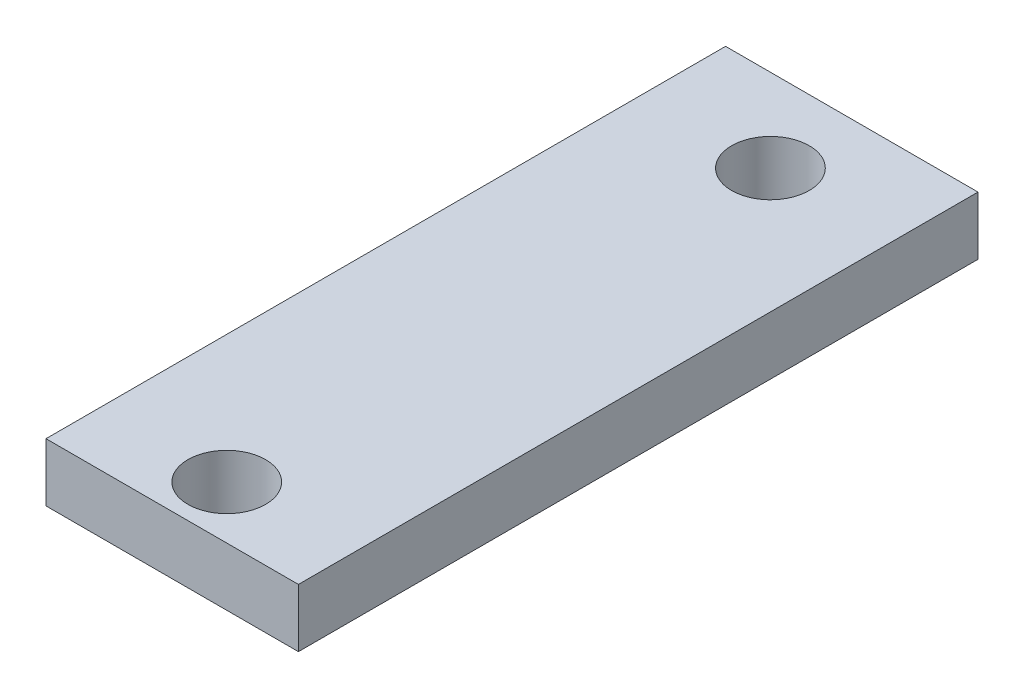
ISO-10303-21;
HEADER;
FILE_DESCRIPTION(('STEP AP214'),'2;1');
FILE_NAME('part.step','',(''),(''),'','','');
FILE_SCHEMA(('AUTOMOTIVE_DESIGN { 1 0 10303 214 1 1 1 1 }'));
ENDSEC;
DATA;
#1=APPLICATION_CONTEXT('core data for automotive mechanical design processes');
#2=APPLICATION_PROTOCOL_DEFINITION('international standard','automotive_design',2000,#1);
#3=PRODUCT_CONTEXT('',#1,'mechanical');
#4=PRODUCT('Part','Part','',(#3));
#5=PRODUCT_RELATED_PRODUCT_CATEGORY('part','',(#4));
#6=PRODUCT_DEFINITION_FORMATION('','',#4);
#7=PRODUCT_DEFINITION_CONTEXT('part definition',#1,'design');
#8=PRODUCT_DEFINITION('design','',#6,#7);
#9=PRODUCT_DEFINITION_SHAPE('','',#8);
#10=(LENGTH_UNIT() NAMED_UNIT(*) SI_UNIT(.MILLI.,.METRE.));
#11=(NAMED_UNIT(*) PLANE_ANGLE_UNIT() SI_UNIT($,.RADIAN.));
#12=(NAMED_UNIT(*) SI_UNIT($,.STERADIAN.) SOLID_ANGLE_UNIT());
#13=UNCERTAINTY_MEASURE_WITH_UNIT(LENGTH_MEASURE(1.E-05),#10,'distance_accuracy_value','');
#14=(GEOMETRIC_REPRESENTATION_CONTEXT(3) GLOBAL_UNCERTAINTY_ASSIGNED_CONTEXT((#13)) GLOBAL_UNIT_ASSIGNED_CONTEXT((#10,
#11,#12)) REPRESENTATION_CONTEXT('',''));
#15=CARTESIAN_POINT('',(0.,0.,0.));
#16=DIRECTION('',(0.,0.,1.));
#17=DIRECTION('',(1.,0.,0.));
#18=AXIS2_PLACEMENT_3D('',#15,#16,#17);
#19=CARTESIAN_POINT('',(0.,3.,0.));
#20=DIRECTION('',(0.,1.,0.));
#21=DIRECTION('',(0.,0.,1.));
#22=AXIS2_PLACEMENT_3D('',#19,#20,#21);
#23=PLANE('',#22);
#24=CARTESIAN_POINT('',(75.1751197649675,3.,-49.8501901542235));
#25=DIRECTION('',(0.,1.,0.));
#26=DIRECTION('',(0.,0.,1.));
#27=AXIS2_PLACEMENT_3D('',#24,#25,#26);
#28=CIRCLE('',#27,2.00000000000001);
#29=CARTESIAN_POINT('',(75.1751197649675,3.,-47.8501901542235));
#30=VERTEX_POINT('',#29);
#31=EDGE_CURVE('E99',#30,#30,#28,.T.);
#32=ORIENTED_EDGE('',*,*,#31,.F.);
#33=EDGE_LOOP('',(#32));
#34=FACE_BOUND('',#33,.T.);
#35=DIRECTION('',(-1.,0.,0.));
#36=VECTOR('',#35,1.);
#37=CARTESIAN_POINT('',(81.5884229106937,3.,-54.127576325532));
#38=LINE('',#37,#36);
#39=CARTESIAN_POINT('',(81.5884229106937,3.,-54.127576325532));
#40=VERTEX_POINT('',#39);
#41=CARTESIAN_POINT('',(68.5884229106937,3.,-54.127576325532));
#42=VERTEX_POINT('',#41);
#43=EDGE_CURVE('E84',#40,#42,#38,.T.);
#44=ORIENTED_EDGE('',*,*,#43,.T.);
#45=DIRECTION('',(0.,0.,1.));
#46=VECTOR('',#45,1.);
#47=CARTESIAN_POINT('',(68.5884229106937,3.,-54.127576325532));
#48=LINE('',#47,#46);
#49=CARTESIAN_POINT('',(68.5884229106937,3.,-19.127576325532));
#50=VERTEX_POINT('',#49);
#51=EDGE_CURVE('E79',#42,#50,#48,.T.);
#52=ORIENTED_EDGE('',*,*,#51,.T.);
#53=DIRECTION('',(1.,0.,0.));
#54=VECTOR('',#53,1.);
#55=CARTESIAN_POINT('',(68.5884229106937,3.,-19.127576325532));
#56=LINE('',#55,#54);
#57=CARTESIAN_POINT('',(81.5884229106937,3.,-19.127576325532));
#58=VERTEX_POINT('',#57);
#59=EDGE_CURVE('E82',#50,#58,#56,.T.);
#60=ORIENTED_EDGE('',*,*,#59,.T.);
#61=DIRECTION('',(0.,0.,-1.));
#62=VECTOR('',#61,1.);
#63=CARTESIAN_POINT('',(81.5884229106937,3.,-19.127576325532));
#64=LINE('',#63,#62);
#65=EDGE_CURVE('E49',#58,#40,#64,.T.);
#66=ORIENTED_EDGE('',*,*,#65,.T.);
#67=EDGE_LOOP('',(#44,#52,#60,#66));
#68=FACE_BOUND('',#67,.T.);
#69=CARTESIAN_POINT('',(75.1751197649675,3.,-21.8501901542235));
#70=DIRECTION('',(0.,1.,0.));
#71=DIRECTION('',(0.,0.,-1.));
#72=AXIS2_PLACEMENT_3D('',#69,#70,#71);
#73=CIRCLE('',#72,2.);
#74=CARTESIAN_POINT('',(75.1751197649675,3.,-23.8501901542235));
#75=VERTEX_POINT('',#74);
#76=EDGE_CURVE('E114',#75,#75,#73,.T.);
#77=ORIENTED_EDGE('',*,*,#76,.F.);
#78=EDGE_LOOP('',(#77));
#79=FACE_BOUND('',#78,.T.);
#80=ADVANCED_FACE('F32',(#34,#68,#79),#23,.T.);
#81=CARTESIAN_POINT('',(0.,0.,0.));
#82=DIRECTION('',(0.,1.,0.));
#83=DIRECTION('',(0.,0.,1.));
#84=AXIS2_PLACEMENT_3D('',#81,#82,#83);
#85=PLANE('',#84);
#86=DIRECTION('',(-1.,0.,0.));
#87=VECTOR('',#86,1.);
#88=CARTESIAN_POINT('',(81.5884229106937,0.,-54.127576325532));
#89=LINE('',#88,#87);
#90=CARTESIAN_POINT('',(81.5884229106937,0.,-54.127576325532));
#91=VERTEX_POINT('',#90);
#92=CARTESIAN_POINT('',(68.5884229106937,0.,-54.127576325532));
#93=VERTEX_POINT('',#92);
#94=EDGE_CURVE('E96',#91,#93,#89,.T.);
#95=ORIENTED_EDGE('',*,*,#94,.F.);
#96=DIRECTION('',(0.,0.,-1.));
#97=VECTOR('',#96,1.);
#98=CARTESIAN_POINT('',(81.5884229106937,0.,-19.127576325532));
#99=LINE('',#98,#97);
#100=CARTESIAN_POINT('',(81.5884229106937,0.,-19.127576325532));
#101=VERTEX_POINT('',#100);
#102=EDGE_CURVE('E72',#101,#91,#99,.T.);
#103=ORIENTED_EDGE('',*,*,#102,.F.);
#104=DIRECTION('',(1.,0.,0.));
#105=VECTOR('',#104,1.);
#106=CARTESIAN_POINT('',(68.5884229106937,0.,-19.127576325532));
#107=LINE('',#106,#105);
#108=CARTESIAN_POINT('',(68.5884229106937,0.,-19.127576325532));
#109=VERTEX_POINT('',#108);
#110=EDGE_CURVE('E66',#109,#101,#107,.T.);
#111=ORIENTED_EDGE('',*,*,#110,.F.);
#112=DIRECTION('',(0.,0.,1.));
#113=VECTOR('',#112,1.);
#114=CARTESIAN_POINT('',(68.5884229106937,0.,-54.127576325532));
#115=LINE('',#114,#113);
#116=EDGE_CURVE('E88',#93,#109,#115,.T.);
#117=ORIENTED_EDGE('',*,*,#116,.F.);
#118=EDGE_LOOP('',(#95,#103,#111,#117));
#119=FACE_BOUND('',#118,.T.);
#120=CARTESIAN_POINT('',(75.1751197649675,0.,-49.8501901542235));
#121=DIRECTION('',(0.,1.,0.));
#122=DIRECTION('',(0.,0.,1.));
#123=AXIS2_PLACEMENT_3D('',#120,#121,#122);
#124=CIRCLE('',#123,2.00000000000001);
#125=CARTESIAN_POINT('',(75.1751197649675,0.,-47.8501901542235));
#126=VERTEX_POINT('',#125);
#127=EDGE_CURVE('E111',#126,#126,#124,.T.);
#128=ORIENTED_EDGE('',*,*,#127,.T.);
#129=EDGE_LOOP('',(#128));
#130=FACE_BOUND('',#129,.T.);
#131=CARTESIAN_POINT('',(75.1751197649675,0.,-21.8501901542235));
#132=DIRECTION('',(0.,1.,0.));
#133=DIRECTION('',(0.,0.,-1.));
#134=AXIS2_PLACEMENT_3D('',#131,#132,#133);
#135=CIRCLE('',#134,2.);
#136=CARTESIAN_POINT('',(75.1751197649675,0.,-23.8501901542235));
#137=VERTEX_POINT('',#136);
#138=EDGE_CURVE('E117',#137,#137,#135,.T.);
#139=ORIENTED_EDGE('',*,*,#138,.T.);
#140=EDGE_LOOP('',(#139));
#141=FACE_BOUND('',#140,.T.);
#142=ADVANCED_FACE('F107',(#119,#130,#141),#85,.F.);
#143=CARTESIAN_POINT('',(81.5884229106937,3.,-54.127576325532));
#144=DIRECTION('',(0.,0.,1.));
#145=DIRECTION('',(1.,0.,0.));
#146=AXIS2_PLACEMENT_3D('',#143,#144,#145);
#147=PLANE('',#146);
#148=ORIENTED_EDGE('',*,*,#94,.T.);
#149=DIRECTION('',(0.,-1.,0.));
#150=VECTOR('',#149,1.);
#151=CARTESIAN_POINT('',(68.5884229106937,3.,-54.127576325532));
#152=LINE('',#151,#150);
#153=EDGE_CURVE('E11',#42,#93,#152,.T.);
#154=ORIENTED_EDGE('',*,*,#153,.F.);
#155=ORIENTED_EDGE('',*,*,#43,.F.);
#156=DIRECTION('',(0.,-1.,0.));
#157=VECTOR('',#156,1.);
#158=CARTESIAN_POINT('',(81.5884229106937,3.,-54.127576325532));
#159=LINE('',#158,#157);
#160=EDGE_CURVE('E92',#40,#91,#159,.T.);
#161=ORIENTED_EDGE('',*,*,#160,.T.);
#162=EDGE_LOOP('',(#148,#154,#155,#161));
#163=FACE_BOUND('',#162,.T.);
#164=ADVANCED_FACE('F34',(#163),#147,.F.);
#165=CARTESIAN_POINT('',(68.5884229106937,3.,-54.127576325532));
#166=DIRECTION('',(1.,0.,0.));
#167=DIRECTION('',(0.,0.,-1.));
#168=AXIS2_PLACEMENT_3D('',#165,#166,#167);
#169=PLANE('',#168);
#170=ORIENTED_EDGE('',*,*,#116,.T.);
#171=DIRECTION('',(0.,-1.,0.));
#172=VECTOR('',#171,1.);
#173=CARTESIAN_POINT('',(68.5884229106937,3.,-19.127576325532));
#174=LINE('',#173,#172);
#175=EDGE_CURVE('E41',#50,#109,#174,.T.);
#176=ORIENTED_EDGE('',*,*,#175,.F.);
#177=ORIENTED_EDGE('',*,*,#51,.F.);
#178=ORIENTED_EDGE('',*,*,#153,.T.);
#179=EDGE_LOOP('',(#170,#176,#177,#178));
#180=FACE_BOUND('',#179,.T.);
#181=ADVANCED_FACE('F87',(#180),#169,.F.);
#182=CARTESIAN_POINT('',(68.5884229106937,3.,-19.127576325532));
#183=DIRECTION('',(0.,0.,-1.));
#184=DIRECTION('',(-1.,0.,0.));
#185=AXIS2_PLACEMENT_3D('',#182,#183,#184);
#186=PLANE('',#185);
#187=ORIENTED_EDGE('',*,*,#110,.T.);
#188=DIRECTION('',(0.,-1.,0.));
#189=VECTOR('',#188,1.);
#190=CARTESIAN_POINT('',(81.5884229106937,3.,-19.127576325532));
#191=LINE('',#190,#189);
#192=EDGE_CURVE('E89',#58,#101,#191,.T.);
#193=ORIENTED_EDGE('',*,*,#192,.F.);
#194=ORIENTED_EDGE('',*,*,#59,.F.);
#195=ORIENTED_EDGE('',*,*,#175,.T.);
#196=EDGE_LOOP('',(#187,#193,#194,#195));
#197=FACE_BOUND('',#196,.T.);
#198=ADVANCED_FACE('F90',(#197),#186,.F.);
#199=CARTESIAN_POINT('',(81.5884229106937,3.,-19.127576325532));
#200=DIRECTION('',(-1.,0.,0.));
#201=DIRECTION('',(0.,0.,1.));
#202=AXIS2_PLACEMENT_3D('',#199,#200,#201);
#203=PLANE('',#202);
#204=ORIENTED_EDGE('',*,*,#102,.T.);
#205=ORIENTED_EDGE('',*,*,#160,.F.);
#206=ORIENTED_EDGE('',*,*,#65,.F.);
#207=ORIENTED_EDGE('',*,*,#192,.T.);
#208=EDGE_LOOP('',(#204,#205,#206,#207));
#209=FACE_BOUND('',#208,.T.);
#210=ADVANCED_FACE('F104',(#209),#203,.F.);
#211=CARTESIAN_POINT('',(75.1751197649675,3.,-49.8501901542235));
#212=DIRECTION('',(0.,-1.,0.));
#213=DIRECTION('',(0.,0.,-1.));
#214=AXIS2_PLACEMENT_3D('',#211,#212,#213);
#215=CYLINDRICAL_SURFACE('',#214,2.00000000000001);
#216=ORIENTED_EDGE('',*,*,#31,.T.);
#217=EDGE_LOOP('',(#216));
#218=FACE_BOUND('',#217,.T.);
#219=ORIENTED_EDGE('',*,*,#127,.F.);
#220=EDGE_LOOP('',(#219));
#221=FACE_BOUND('',#220,.T.);
#222=ADVANCED_FACE('F134',(#218,#221),#215,.F.);
#223=CARTESIAN_POINT('',(75.1751197649675,3.,-21.8501901542235));
#224=DIRECTION('',(0.,-1.,0.));
#225=DIRECTION('',(0.,0.,-1.));
#226=AXIS2_PLACEMENT_3D('',#223,#224,#225);
#227=CYLINDRICAL_SURFACE('',#226,2.);
#228=ORIENTED_EDGE('',*,*,#76,.T.);
#229=EDGE_LOOP('',(#228));
#230=FACE_BOUND('',#229,.T.);
#231=ORIENTED_EDGE('',*,*,#138,.F.);
#232=EDGE_LOOP('',(#231));
#233=FACE_BOUND('',#232,.T.);
#234=ADVANCED_FACE('F123',(#230,#233),#227,.F.);
#235=CLOSED_SHELL('',(#80,#142,#164,#181,#198,#210,#222,#234));
#236=MANIFOLD_SOLID_BREP('B2',#235);
#237=ADVANCED_BREP_SHAPE_REPRESENTATION('',(#18,#236),#14);
#238=SHAPE_DEFINITION_REPRESENTATION(#9,#237);
ENDSEC;
END-ISO-10303-21;
